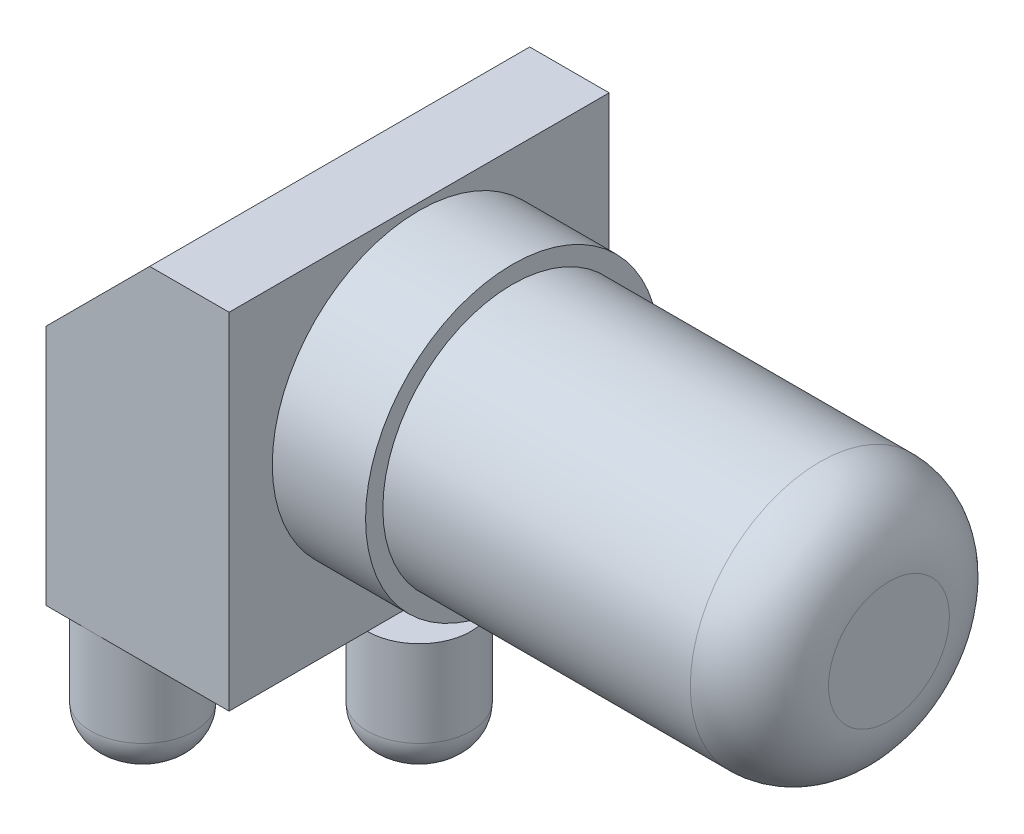
ISO-10303-21;
HEADER;
FILE_DESCRIPTION(('STEP AP214'),'2;1');
FILE_NAME('part.step','',(''),(''),'','','');
FILE_SCHEMA(('AUTOMOTIVE_DESIGN { 1 0 10303 214 1 1 1 1 }'));
ENDSEC;
DATA;
#1=APPLICATION_CONTEXT('core data for automotive mechanical design processes');
#2=APPLICATION_PROTOCOL_DEFINITION('international standard','automotive_design',2000,#1);
#3=PRODUCT_CONTEXT('',#1,'mechanical');
#4=PRODUCT('Part','Part','',(#3));
#5=PRODUCT_RELATED_PRODUCT_CATEGORY('part','',(#4));
#6=PRODUCT_DEFINITION_FORMATION('','',#4);
#7=PRODUCT_DEFINITION_CONTEXT('part definition',#1,'design');
#8=PRODUCT_DEFINITION('design','',#6,#7);
#9=PRODUCT_DEFINITION_SHAPE('','',#8);
#10=(LENGTH_UNIT() NAMED_UNIT(*) SI_UNIT(.MILLI.,.METRE.));
#11=(NAMED_UNIT(*) PLANE_ANGLE_UNIT() SI_UNIT($,.RADIAN.));
#12=(NAMED_UNIT(*) SI_UNIT($,.STERADIAN.) SOLID_ANGLE_UNIT());
#13=UNCERTAINTY_MEASURE_WITH_UNIT(LENGTH_MEASURE(1.E-05),#10,'distance_accuracy_value','');
#14=(GEOMETRIC_REPRESENTATION_CONTEXT(3) GLOBAL_UNCERTAINTY_ASSIGNED_CONTEXT((#13)) GLOBAL_UNIT_ASSIGNED_CONTEXT((#10,
#11,#12)) REPRESENTATION_CONTEXT('',''));
#15=CARTESIAN_POINT('',(0.,0.,0.));
#16=DIRECTION('',(0.,0.,1.));
#17=DIRECTION('',(1.,0.,0.));
#18=AXIS2_PLACEMENT_3D('',#15,#16,#17);
#19=CARTESIAN_POINT('',(9.144,7.0485,0.));
#20=DIRECTION('',(1.,0.,0.));
#21=DIRECTION('',(0.,0.,-1.));
#22=AXIS2_PLACEMENT_3D('',#19,#20,#21);
#23=PLANE('',#22);
#24=CARTESIAN_POINT('',(9.144,7.0485,0.));
#25=DIRECTION('',(1.,0.,0.));
#26=DIRECTION('',(0.,0.,-1.));
#27=AXIS2_PLACEMENT_3D('',#24,#25,#26);
#28=CIRCLE('',#27,5.3975);
#29=CARTESIAN_POINT('',(9.144,7.0485,-5.3975));
#30=VERTEX_POINT('',#29);
#31=EDGE_CURVE('E142',#30,#30,#28,.T.);
#32=ORIENTED_EDGE('',*,*,#31,.T.);
#33=EDGE_LOOP('',(#32));
#34=FACE_BOUND('',#33,.T.);
#35=CARTESIAN_POINT('',(9.144,7.0485,0.));
#36=DIRECTION('',(1.,0.,0.));
#37=DIRECTION('',(0.,0.,-1.));
#38=AXIS2_PLACEMENT_3D('',#35,#36,#37);
#39=CIRCLE('',#38,4.7625);
#40=CARTESIAN_POINT('',(9.144,7.0485,-4.7625));
#41=VERTEX_POINT('',#40);
#42=EDGE_CURVE('E148',#41,#41,#39,.T.);
#43=ORIENTED_EDGE('',*,*,#42,.F.);
#44=EDGE_LOOP('',(#43));
#45=FACE_BOUND('',#44,.T.);
#46=ADVANCED_FACE('F34',(#34,#45),#23,.T.);
#47=CARTESIAN_POINT('',(5.715,12.7,-6.985));
#48=DIRECTION('',(-1.,0.,0.));
#49=DIRECTION('',(0.,0.,1.));
#50=AXIS2_PLACEMENT_3D('',#47,#48,#49);
#51=PLANE('',#50);
#52=DIRECTION('',(0.,0.,-1.));
#53=VECTOR('',#52,1.);
#54=CARTESIAN_POINT('',(5.715,0.,-6.985));
#55=LINE('',#54,#53);
#56=CARTESIAN_POINT('',(5.715,0.,6.985));
#57=VERTEX_POINT('',#56);
#58=CARTESIAN_POINT('',(5.715,0.,1.905));
#59=VERTEX_POINT('',#58);
#60=EDGE_CURVE('E158',#57,#59,#55,.T.);
#61=ORIENTED_EDGE('',*,*,#60,.T.);
#62=CARTESIAN_POINT('',(5.715,0.,-1.905));
#63=VERTEX_POINT('',#62);
#64=EDGE_CURVE('E174',#59,#63,#55,.T.);
#65=ORIENTED_EDGE('',*,*,#64,.T.);
#66=CARTESIAN_POINT('',(5.715,0.,-6.985));
#67=VERTEX_POINT('',#66);
#68=EDGE_CURVE('E171',#63,#67,#55,.T.);
#69=ORIENTED_EDGE('',*,*,#68,.T.);
#70=DIRECTION('',(0.,-1.,0.));
#71=VECTOR('',#70,1.);
#72=CARTESIAN_POINT('',(5.715,12.7,-6.985));
#73=LINE('',#72,#71);
#74=CARTESIAN_POINT('',(5.715,12.7,-6.985));
#75=VERTEX_POINT('',#74);
#76=EDGE_CURVE('E162',#75,#67,#73,.T.);
#77=ORIENTED_EDGE('',*,*,#76,.F.);
#78=DIRECTION('',(0.,0.,-1.));
#79=VECTOR('',#78,1.);
#80=CARTESIAN_POINT('',(5.715,12.7,-6.985));
#81=LINE('',#80,#79);
#82=CARTESIAN_POINT('',(5.715,12.7,6.985));
#83=VERTEX_POINT('',#82);
#84=EDGE_CURVE('E160',#83,#75,#81,.T.);
#85=ORIENTED_EDGE('',*,*,#84,.F.);
#86=DIRECTION('',(0.,-1.,0.));
#87=VECTOR('',#86,1.);
#88=CARTESIAN_POINT('',(5.715,12.7,6.985));
#89=LINE('',#88,#87);
#90=EDGE_CURVE('E177',#83,#57,#89,.T.);
#91=ORIENTED_EDGE('',*,*,#90,.T.);
#92=EDGE_LOOP('',(#61,#65,#69,#77,#85,#91));
#93=FACE_BOUND('',#92,.T.);
#94=CARTESIAN_POINT('',(5.715,7.0485,0.));
#95=DIRECTION('',(-1.,0.,0.));
#96=DIRECTION('',(0.,0.,1.));
#97=AXIS2_PLACEMENT_3D('',#94,#95,#96);
#98=CIRCLE('',#97,5.3975);
#99=CARTESIAN_POINT('',(5.715,7.0485,5.3975));
#100=VERTEX_POINT('',#99);
#101=EDGE_CURVE('E200',#100,#100,#98,.F.);
#102=ORIENTED_EDGE('',*,*,#101,.F.);
#103=EDGE_LOOP('',(#102));
#104=FACE_BOUND('',#103,.T.);
#105=ADVANCED_FACE('F239',(#93,#104),#51,.F.);
#106=CARTESIAN_POINT('',(5.715,0.,-6.985));
#107=DIRECTION('',(0.,-1.,0.));
#108=DIRECTION('',(0.,0.,-1.));
#109=AXIS2_PLACEMENT_3D('',#106,#107,#108);
#110=PLANE('',#109);
#111=CARTESIAN_POINT('',(0.634999999999997,0.,5.08));
#112=DIRECTION('',(0.,-1.,0.));
#113=DIRECTION('',(0.,0.,-1.));
#114=AXIS2_PLACEMENT_3D('',#111,#112,#113);
#115=CIRCLE('',#114,1.90499999999999);
#116=CARTESIAN_POINT('',(0.634999999999997,0.,6.98499999999999));
#117=VERTEX_POINT('',#116);
#118=CARTESIAN_POINT('',(-1.016,0.,6.03038097624057));
#119=VERTEX_POINT('',#118);
#120=EDGE_CURVE('E189',#117,#119,#115,.T.);
#121=ORIENTED_EDGE('',*,*,#120,.F.);
#122=DIRECTION('',(1.,0.,0.));
#123=VECTOR('',#122,1.);
#124=CARTESIAN_POINT('',(-1.016,0.,6.985));
#125=LINE('',#124,#123);
#126=CARTESIAN_POINT('',(-1.016,0.,6.985));
#127=VERTEX_POINT('',#126);
#128=EDGE_CURVE('E169',#127,#117,#125,.T.);
#129=ORIENTED_EDGE('',*,*,#128,.F.);
#130=DIRECTION('',(0.,0.,1.));
#131=VECTOR('',#130,1.);
#132=CARTESIAN_POINT('',(-1.016,0.,-6.985));
#133=LINE('',#132,#131);
#134=EDGE_CURVE('E123',#119,#127,#133,.T.);
#135=ORIENTED_EDGE('',*,*,#134,.F.);
#136=EDGE_LOOP('',(#121,#129,#135));
#137=FACE_BOUND('',#136,.T.);
#138=ADVANCED_FACE('F245',(#137),#110,.T.);
#139=CARTESIAN_POINT('',(0.634999999999997,-4.445,-5.08));
#140=DIRECTION('',(0.,1.,0.));
#141=DIRECTION('',(0.,0.,1.));
#142=AXIS2_PLACEMENT_3D('',#139,#140,#141);
#143=CYLINDRICAL_SURFACE('',#142,1.90499999999999);
#144=CARTESIAN_POINT('',(0.634999999999997,-3.175,-5.08));
#145=DIRECTION('',(0.,1.,0.));
#146=DIRECTION('',(0.,0.,1.));
#147=AXIS2_PLACEMENT_3D('',#144,#145,#146);
#148=CIRCLE('',#147,1.90499999999999);
#149=CARTESIAN_POINT('',(0.634999999999997,-3.175,-3.17500000000001));
#150=VERTEX_POINT('',#149);
#151=EDGE_CURVE('E212',#150,#150,#148,.T.);
#152=ORIENTED_EDGE('',*,*,#151,.T.);
#153=EDGE_LOOP('',(#152));
#154=FACE_BOUND('',#153,.T.);
#155=CARTESIAN_POINT('',(0.634999999999997,0.,-5.08));
#156=DIRECTION('',(0.,1.,0.));
#157=DIRECTION('',(0.,0.,1.));
#158=AXIS2_PLACEMENT_3D('',#155,#156,#157);
#159=CIRCLE('',#158,1.90499999999999);
#160=CARTESIAN_POINT('',(0.634999999999997,0.,-6.985));
#161=VERTEX_POINT('',#160);
#162=CARTESIAN_POINT('',(-1.016,0.,-6.03038097624057));
#163=VERTEX_POINT('',#162);
#164=EDGE_CURVE('E185',#161,#163,#159,.T.);
#165=ORIENTED_EDGE('',*,*,#164,.F.);
#166=CARTESIAN_POINT('',(-1.016,0.,-4.12961902375943));
#167=VERTEX_POINT('',#166);
#168=EDGE_CURVE('E184',#167,#161,#159,.T.);
#169=ORIENTED_EDGE('',*,*,#168,.F.);
#170=EDGE_CURVE('E188',#163,#167,#159,.T.);
#171=ORIENTED_EDGE('',*,*,#170,.F.);
#172=EDGE_LOOP('',(#165,#169,#171));
#173=FACE_BOUND('',#172,.T.);
#174=ADVANCED_FACE('F305',(#154,#173),#143,.T.);
#175=CARTESIAN_POINT('',(0.634999999999997,-4.445,-5.08));
#176=DIRECTION('',(0.,1.,0.));
#177=DIRECTION('',(0.,0.,1.));
#178=AXIS2_PLACEMENT_3D('',#175,#176,#177);
#179=PLANE('',#178);
#180=CARTESIAN_POINT('',(0.634999999999997,-4.445,-5.08));
#181=DIRECTION('',(0.,1.,0.));
#182=DIRECTION('',(0.,0.,1.));
#183=AXIS2_PLACEMENT_3D('',#180,#181,#182);
#184=CIRCLE('',#183,0.634999999999993);
#185=CARTESIAN_POINT('',(0.634999999999997,-4.445,-4.44500000000001));
#186=VERTEX_POINT('',#185);
#187=EDGE_CURVE('E215',#186,#186,#184,.F.);
#188=ORIENTED_EDGE('',*,*,#187,.T.);
#189=EDGE_LOOP('',(#188));
#190=FACE_BOUND('',#189,.T.);
#191=ADVANCED_FACE('F301',(#190),#179,.F.);
#192=CARTESIAN_POINT('',(0.634999999999997,0.,-5.08));
#193=DIRECTION('',(0.,1.,0.));
#194=DIRECTION('',(0.,0.,1.));
#195=AXIS2_PLACEMENT_3D('',#192,#193,#194);
#196=PLANE('',#195);
#197=EDGE_CURVE('E168',#163,#167,#133,.T.);
#198=ORIENTED_EDGE('',*,*,#197,.F.);
#199=ORIENTED_EDGE('',*,*,#170,.T.);
#200=EDGE_LOOP('',(#198,#199));
#201=FACE_BOUND('',#200,.T.);
#202=ADVANCED_FACE('F304',(#201),#196,.T.);
#203=DIRECTION('',(-1.,0.,0.));
#204=VECTOR('',#203,1.);
#205=CARTESIAN_POINT('',(-1.016,0.,-6.985));
#206=LINE('',#205,#204);
#207=CARTESIAN_POINT('',(-1.016,0.,-6.985));
#208=VERTEX_POINT('',#207);
#209=EDGE_CURVE('E153',#161,#208,#206,.T.);
#210=ORIENTED_EDGE('',*,*,#209,.F.);
#211=ORIENTED_EDGE('',*,*,#164,.T.);
#212=EDGE_CURVE('E133',#208,#163,#133,.T.);
#213=ORIENTED_EDGE('',*,*,#212,.F.);
#214=EDGE_LOOP('',(#210,#211,#213));
#215=FACE_BOUND('',#214,.T.);
#216=ADVANCED_FACE('F291',(#215),#110,.T.);
#217=CARTESIAN_POINT('',(-1.016,12.7,-6.985));
#218=DIRECTION('',(0.,0.,1.));
#219=DIRECTION('',(1.,0.,0.));
#220=AXIS2_PLACEMENT_3D('',#217,#218,#219);
#221=PLANE('',#220);
#222=DIRECTION('',(0.,-1.,0.));
#223=VECTOR('',#222,1.);
#224=CARTESIAN_POINT('',(-1.016,12.7,-6.985));
#225=LINE('',#224,#223);
#226=CARTESIAN_POINT('',(-1.016,8.88999999999998,-6.985));
#227=VERTEX_POINT('',#226);
#228=EDGE_CURVE('E182',#227,#208,#225,.T.);
#229=ORIENTED_EDGE('',*,*,#228,.F.);
#230=DIRECTION('',(-0.707106781186546,-0.707106781186549,0.));
#231=VECTOR('',#230,1.);
#232=CARTESIAN_POINT('',(2.794,12.7,-6.985));
#233=LINE('',#232,#231);
#234=CARTESIAN_POINT('',(2.794,12.7,-6.985));
#235=VERTEX_POINT('',#234);
#236=EDGE_CURVE('E198',#227,#235,#233,.F.);
#237=ORIENTED_EDGE('',*,*,#236,.T.);
#238=DIRECTION('',(-1.,0.,0.));
#239=VECTOR('',#238,1.);
#240=CARTESIAN_POINT('',(-1.016,12.7,-6.985));
#241=LINE('',#240,#239);
#242=EDGE_CURVE('E154',#75,#235,#241,.T.);
#243=ORIENTED_EDGE('',*,*,#242,.F.);
#244=ORIENTED_EDGE('',*,*,#76,.T.);
#245=EDGE_CURVE('E163',#67,#161,#206,.T.);
#246=ORIENTED_EDGE('',*,*,#245,.T.);
#247=ORIENTED_EDGE('',*,*,#209,.T.);
#248=EDGE_LOOP('',(#229,#237,#243,#244,#246,#247));
#249=FACE_BOUND('',#248,.T.);
#250=ADVANCED_FACE('F297',(#249),#221,.F.);
#251=CARTESIAN_POINT('',(-1.016,12.7,-6.985));
#252=DIRECTION('',(1.,0.,0.));
#253=DIRECTION('',(0.,0.,-1.));
#254=AXIS2_PLACEMENT_3D('',#251,#252,#253);
#255=PLANE('',#254);
#256=DIRECTION('',(0.,-1.,0.));
#257=VECTOR('',#256,1.);
#258=CARTESIAN_POINT('',(-1.016,12.7,6.985));
#259=LINE('',#258,#257);
#260=CARTESIAN_POINT('',(-1.016,8.88999999999998,6.985));
#261=VERTEX_POINT('',#260);
#262=EDGE_CURVE('E180',#261,#127,#259,.T.);
#263=ORIENTED_EDGE('',*,*,#262,.F.);
#264=DIRECTION('',(0.,0.,-1.));
#265=VECTOR('',#264,1.);
#266=CARTESIAN_POINT('',(-1.016,8.88999999999998,-6.985));
#267=LINE('',#266,#265);
#268=EDGE_CURVE('E49',#261,#227,#267,.T.);
#269=ORIENTED_EDGE('',*,*,#268,.T.);
#270=ORIENTED_EDGE('',*,*,#228,.T.);
#271=ORIENTED_EDGE('',*,*,#212,.T.);
#272=ORIENTED_EDGE('',*,*,#197,.T.);
#273=CARTESIAN_POINT('',(-1.016,0.,-0.761999999999998));
#274=VERTEX_POINT('',#273);
#275=EDGE_CURVE('E118',#167,#274,#133,.T.);
#276=ORIENTED_EDGE('',*,*,#275,.T.);
#277=CARTESIAN_POINT('',(-1.016,0.,0.761999999999998));
#278=VERTEX_POINT('',#277);
#279=EDGE_CURVE('E110',#274,#278,#133,.T.);
#280=ORIENTED_EDGE('',*,*,#279,.T.);
#281=CARTESIAN_POINT('',(-1.016,0.,4.12961902375943));
#282=VERTEX_POINT('',#281);
#283=EDGE_CURVE('E114',#278,#282,#133,.T.);
#284=ORIENTED_EDGE('',*,*,#283,.T.);
#285=EDGE_CURVE('E132',#282,#119,#133,.T.);
#286=ORIENTED_EDGE('',*,*,#285,.T.);
#287=ORIENTED_EDGE('',*,*,#134,.T.);
#288=EDGE_LOOP('',(#263,#269,#270,#271,#272,#276,#280,#284,#286,#287));
#289=FACE_BOUND('',#288,.T.);
#290=ADVANCED_FACE('F112',(#289),#255,.F.);
#291=CARTESIAN_POINT('',(-1.016,12.7,6.985));
#292=DIRECTION('',(0.,0.,-1.));
#293=DIRECTION('',(-1.,0.,0.));
#294=AXIS2_PLACEMENT_3D('',#291,#292,#293);
#295=PLANE('',#294);
#296=DIRECTION('',(1.,0.,0.));
#297=VECTOR('',#296,1.);
#298=CARTESIAN_POINT('',(-1.016,12.7,6.985));
#299=LINE('',#298,#297);
#300=CARTESIAN_POINT('',(2.794,12.7,6.985));
#301=VERTEX_POINT('',#300);
#302=EDGE_CURVE('E157',#301,#83,#299,.T.);
#303=ORIENTED_EDGE('',*,*,#302,.F.);
#304=DIRECTION('',(0.707106781186546,0.707106781186549,0.));
#305=VECTOR('',#304,1.);
#306=CARTESIAN_POINT('',(2.794,12.7,6.985));
#307=LINE('',#306,#305);
#308=EDGE_CURVE('E57',#301,#261,#307,.F.);
#309=ORIENTED_EDGE('',*,*,#308,.T.);
#310=ORIENTED_EDGE('',*,*,#262,.T.);
#311=ORIENTED_EDGE('',*,*,#128,.T.);
#312=EDGE_CURVE('E167',#117,#57,#125,.T.);
#313=ORIENTED_EDGE('',*,*,#312,.T.);
#314=ORIENTED_EDGE('',*,*,#90,.F.);
#315=EDGE_LOOP('',(#303,#309,#310,#311,#313,#314));
#316=FACE_BOUND('',#315,.T.);
#317=ADVANCED_FACE('F288',(#316),#295,.F.);
#318=CARTESIAN_POINT('',(5.715,12.7,-6.985));
#319=DIRECTION('',(0.,-1.,0.));
#320=DIRECTION('',(0.,0.,-1.));
#321=AXIS2_PLACEMENT_3D('',#318,#319,#320);
#322=PLANE('',#321);
#323=ORIENTED_EDGE('',*,*,#242,.T.);
#324=DIRECTION('',(0.,0.,1.));
#325=VECTOR('',#324,1.);
#326=CARTESIAN_POINT('',(2.794,12.7,-6.985));
#327=LINE('',#326,#325);
#328=EDGE_CURVE('E137',#235,#301,#327,.T.);
#329=ORIENTED_EDGE('',*,*,#328,.T.);
#330=ORIENTED_EDGE('',*,*,#302,.T.);
#331=ORIENTED_EDGE('',*,*,#84,.T.);
#332=EDGE_LOOP('',(#323,#329,#330,#331));
#333=FACE_BOUND('',#332,.T.);
#334=ADVANCED_FACE('F285',(#333),#322,.F.);
#335=CARTESIAN_POINT('',(0.,0.,0.));
#336=DIRECTION('',(0.,-1.,0.));
#337=DIRECTION('',(0.,0.,-1.));
#338=AXIS2_PLACEMENT_3D('',#335,#336,#337);
#339=CIRCLE('',#338,1.27);
#340=EDGE_CURVE('E127',#274,#278,#339,.T.);
#341=ORIENTED_EDGE('',*,*,#340,.F.);
#342=ORIENTED_EDGE('',*,*,#275,.F.);
#343=ORIENTED_EDGE('',*,*,#168,.T.);
#344=ORIENTED_EDGE('',*,*,#245,.F.);
#345=ORIENTED_EDGE('',*,*,#68,.F.);
#346=CARTESIAN_POINT('',(5.715,0.,0.));
#347=DIRECTION('',(0.,-1.,0.));
#348=DIRECTION('',(0.,0.,-1.));
#349=AXIS2_PLACEMENT_3D('',#346,#347,#348);
#350=CIRCLE('',#349,1.905);
#351=EDGE_CURVE('E138',#59,#63,#350,.T.);
#352=ORIENTED_EDGE('',*,*,#351,.F.);
#353=ORIENTED_EDGE('',*,*,#60,.F.);
#354=ORIENTED_EDGE('',*,*,#312,.F.);
#355=CARTESIAN_POINT('',(0.634999999999997,0.,5.08));
#356=DIRECTION('',(0.,1.,0.));
#357=DIRECTION('',(0.,0.,1.));
#358=AXIS2_PLACEMENT_3D('',#355,#356,#357);
#359=CIRCLE('',#358,1.90499999999999);
#360=EDGE_CURVE('E130',#117,#282,#359,.T.);
#361=ORIENTED_EDGE('',*,*,#360,.T.);
#362=ORIENTED_EDGE('',*,*,#283,.F.);
#363=EDGE_LOOP('',(#341,#342,#343,#344,#345,#352,#353,#354,#361,#362));
#364=FACE_BOUND('',#363,.T.);
#365=ADVANCED_FACE('F126',(#364),#110,.T.);
#366=CARTESIAN_POINT('',(0.634999999999997,0.,5.08));
#367=DIRECTION('',(0.,1.,0.));
#368=DIRECTION('',(0.,0.,1.));
#369=AXIS2_PLACEMENT_3D('',#366,#367,#368);
#370=PLANE('',#369);
#371=ORIENTED_EDGE('',*,*,#285,.F.);
#372=EDGE_CURVE('E145',#282,#119,#359,.T.);
#373=ORIENTED_EDGE('',*,*,#372,.T.);
#374=EDGE_LOOP('',(#371,#373));
#375=FACE_BOUND('',#374,.T.);
#376=ADVANCED_FACE('F279',(#375),#370,.T.);
#377=CARTESIAN_POINT('',(0.634999999999997,-4.445,5.08));
#378=DIRECTION('',(0.,1.,0.));
#379=DIRECTION('',(0.,0.,1.));
#380=AXIS2_PLACEMENT_3D('',#377,#378,#379);
#381=CYLINDRICAL_SURFACE('',#380,1.90499999999999);
#382=CARTESIAN_POINT('',(0.634999999999997,-3.175,5.08));
#383=DIRECTION('',(0.,1.,0.));
#384=DIRECTION('',(0.,0.,1.));
#385=AXIS2_PLACEMENT_3D('',#382,#383,#384);
#386=CIRCLE('',#385,1.90499999999999);
#387=CARTESIAN_POINT('',(0.634999999999997,-3.175,6.98499999999999));
#388=VERTEX_POINT('',#387);
#389=EDGE_CURVE('E42',#388,#388,#386,.T.);
#390=ORIENTED_EDGE('',*,*,#389,.T.);
#391=EDGE_LOOP('',(#390));
#392=FACE_BOUND('',#391,.T.);
#393=ORIENTED_EDGE('',*,*,#360,.F.);
#394=ORIENTED_EDGE('',*,*,#120,.T.);
#395=ORIENTED_EDGE('',*,*,#372,.F.);
#396=EDGE_LOOP('',(#393,#394,#395));
#397=FACE_BOUND('',#396,.T.);
#398=ADVANCED_FACE('F226',(#392,#397),#381,.T.);
#399=CARTESIAN_POINT('',(0.634999999999997,-4.445,5.08));
#400=DIRECTION('',(0.,1.,0.));
#401=DIRECTION('',(0.,0.,1.));
#402=AXIS2_PLACEMENT_3D('',#399,#400,#401);
#403=PLANE('',#402);
#404=CARTESIAN_POINT('',(0.634999999999997,-4.445,5.08));
#405=DIRECTION('',(0.,1.,0.));
#406=DIRECTION('',(0.,0.,1.));
#407=AXIS2_PLACEMENT_3D('',#404,#405,#406);
#408=CIRCLE('',#407,0.634999999999993);
#409=CARTESIAN_POINT('',(0.634999999999997,-4.445,5.71499999999999));
#410=VERTEX_POINT('',#409);
#411=EDGE_CURVE('E11',#410,#410,#408,.F.);
#412=ORIENTED_EDGE('',*,*,#411,.T.);
#413=EDGE_LOOP('',(#412));
#414=FACE_BOUND('',#413,.T.);
#415=ADVANCED_FACE('F271',(#414),#403,.F.);
#416=CARTESIAN_POINT('',(5.715,0.,0.));
#417=DIRECTION('',(0.,1.,0.));
#418=DIRECTION('',(0.,0.,1.));
#419=AXIS2_PLACEMENT_3D('',#416,#417,#418);
#420=PLANE('',#419);
#421=ORIENTED_EDGE('',*,*,#64,.F.);
#422=CARTESIAN_POINT('',(5.715,0.,0.));
#423=DIRECTION('',(0.,1.,0.));
#424=DIRECTION('',(0.,0.,1.));
#425=AXIS2_PLACEMENT_3D('',#422,#423,#424);
#426=CIRCLE('',#425,1.905);
#427=EDGE_CURVE('E141',#59,#63,#426,.T.);
#428=ORIENTED_EDGE('',*,*,#427,.T.);
#429=EDGE_LOOP('',(#421,#428));
#430=FACE_BOUND('',#429,.T.);
#431=ADVANCED_FACE('F268',(#430),#420,.T.);
#432=CARTESIAN_POINT('',(5.715,-4.445,0.));
#433=DIRECTION('',(0.,1.,0.));
#434=DIRECTION('',(0.,0.,1.));
#435=AXIS2_PLACEMENT_3D('',#432,#433,#434);
#436=CYLINDRICAL_SURFACE('',#435,1.905);
#437=CARTESIAN_POINT('',(5.715,-3.175,0.));
#438=DIRECTION('',(0.,1.,0.));
#439=DIRECTION('',(0.,0.,1.));
#440=AXIS2_PLACEMENT_3D('',#437,#438,#439);
#441=CIRCLE('',#440,1.905);
#442=CARTESIAN_POINT('',(5.715,-3.175,1.905));
#443=VERTEX_POINT('',#442);
#444=EDGE_CURVE('E218',#443,#443,#441,.T.);
#445=ORIENTED_EDGE('',*,*,#444,.T.);
#446=EDGE_LOOP('',(#445));
#447=FACE_BOUND('',#446,.T.);
#448=ORIENTED_EDGE('',*,*,#427,.F.);
#449=ORIENTED_EDGE('',*,*,#351,.T.);
#450=EDGE_LOOP('',(#448,#449));
#451=FACE_BOUND('',#450,.T.);
#452=ADVANCED_FACE('F266',(#447,#451),#436,.T.);
#453=CARTESIAN_POINT('',(5.715,-4.445,0.));
#454=DIRECTION('',(0.,1.,0.));
#455=DIRECTION('',(0.,0.,1.));
#456=AXIS2_PLACEMENT_3D('',#453,#454,#455);
#457=PLANE('',#456);
#458=CARTESIAN_POINT('',(5.715,-4.445,0.));
#459=DIRECTION('',(0.,1.,0.));
#460=DIRECTION('',(0.,0.,1.));
#461=AXIS2_PLACEMENT_3D('',#458,#459,#460);
#462=CIRCLE('',#461,0.635);
#463=CARTESIAN_POINT('',(5.715,-4.445,0.635));
#464=VERTEX_POINT('',#463);
#465=EDGE_CURVE('E221',#464,#464,#462,.F.);
#466=ORIENTED_EDGE('',*,*,#465,.T.);
#467=EDGE_LOOP('',(#466));
#468=FACE_BOUND('',#467,.T.);
#469=ADVANCED_FACE('F260',(#468),#457,.F.);
#470=CARTESIAN_POINT('',(0.,0.,0.));
#471=DIRECTION('',(0.,1.,0.));
#472=DIRECTION('',(0.,0.,1.));
#473=AXIS2_PLACEMENT_3D('',#470,#471,#472);
#474=PLANE('',#473);
#475=ORIENTED_EDGE('',*,*,#279,.F.);
#476=CARTESIAN_POINT('',(0.,0.,0.));
#477=DIRECTION('',(0.,1.,0.));
#478=DIRECTION('',(0.,0.,1.));
#479=AXIS2_PLACEMENT_3D('',#476,#477,#478);
#480=CIRCLE('',#479,1.27);
#481=EDGE_CURVE('E136',#274,#278,#480,.T.);
#482=ORIENTED_EDGE('',*,*,#481,.T.);
#483=EDGE_LOOP('',(#475,#482));
#484=FACE_BOUND('',#483,.T.);
#485=ADVANCED_FACE('F140',(#484),#474,.T.);
#486=CARTESIAN_POINT('',(0.,-4.445,0.));
#487=DIRECTION('',(0.,1.,0.));
#488=DIRECTION('',(0.,0.,1.));
#489=AXIS2_PLACEMENT_3D('',#486,#487,#488);
#490=CYLINDRICAL_SURFACE('',#489,1.27);
#491=CARTESIAN_POINT('',(0.,-3.175,0.));
#492=DIRECTION('',(0.,1.,0.));
#493=DIRECTION('',(0.,0.,1.));
#494=AXIS2_PLACEMENT_3D('',#491,#492,#493);
#495=CIRCLE('',#494,1.27);
#496=CARTESIAN_POINT('',(0.,-3.175,1.27));
#497=VERTEX_POINT('',#496);
#498=EDGE_CURVE('E209',#497,#497,#495,.T.);
#499=ORIENTED_EDGE('',*,*,#498,.T.);
#500=EDGE_LOOP('',(#499));
#501=FACE_BOUND('',#500,.T.);
#502=ORIENTED_EDGE('',*,*,#481,.F.);
#503=ORIENTED_EDGE('',*,*,#340,.T.);
#504=EDGE_LOOP('',(#502,#503));
#505=FACE_BOUND('',#504,.T.);
#506=ADVANCED_FACE('F135',(#501,#505),#490,.T.);
#507=CARTESIAN_POINT('',(2.794,12.7,-6.985));
#508=DIRECTION('',(0.707106781186549,-0.707106781186546,0.));
#509=DIRECTION('',(0.707106781186546,0.707106781186549,0.));
#510=AXIS2_PLACEMENT_3D('',#507,#508,#509);
#511=PLANE('',#510);
#512=ORIENTED_EDGE('',*,*,#236,.F.);
#513=ORIENTED_EDGE('',*,*,#268,.F.);
#514=ORIENTED_EDGE('',*,*,#308,.F.);
#515=ORIENTED_EDGE('',*,*,#328,.F.);
#516=EDGE_LOOP('',(#512,#513,#514,#515));
#517=FACE_BOUND('',#516,.T.);
#518=ADVANCED_FACE('F256',(#517),#511,.F.);
#519=CARTESIAN_POINT('',(9.144,7.0485,0.));
#520=DIRECTION('',(-1.,0.,0.));
#521=DIRECTION('',(0.,0.,1.));
#522=AXIS2_PLACEMENT_3D('',#519,#520,#521);
#523=CYLINDRICAL_SURFACE('',#522,5.3975);
#524=ORIENTED_EDGE('',*,*,#31,.F.);
#525=EDGE_LOOP('',(#524));
#526=FACE_BOUND('',#525,.T.);
#527=ORIENTED_EDGE('',*,*,#101,.T.);
#528=EDGE_LOOP('',(#527));
#529=FACE_BOUND('',#528,.T.);
#530=ADVANCED_FACE('F253',(#526,#529),#523,.T.);
#531=CARTESIAN_POINT('',(22.987,7.0485,0.));
#532=DIRECTION('',(-1.,0.,0.));
#533=DIRECTION('',(0.,0.,1.));
#534=AXIS2_PLACEMENT_3D('',#531,#532,#533);
#535=CYLINDRICAL_SURFACE('',#534,4.7625);
#536=CARTESIAN_POINT('',(20.447,7.0485,0.));
#537=DIRECTION('',(1.,0.,0.));
#538=DIRECTION('',(0.,0.,-1.));
#539=AXIS2_PLACEMENT_3D('',#536,#537,#538);
#540=CIRCLE('',#539,4.7625);
#541=CARTESIAN_POINT('',(20.447,7.0485,-4.7625));
#542=VERTEX_POINT('',#541);
#543=EDGE_CURVE('E206',#542,#542,#540,.F.);
#544=ORIENTED_EDGE('',*,*,#543,.T.);
#545=EDGE_LOOP('',(#544));
#546=FACE_BOUND('',#545,.T.);
#547=ORIENTED_EDGE('',*,*,#42,.T.);
#548=EDGE_LOOP('',(#547));
#549=FACE_BOUND('',#548,.T.);
#550=ADVANCED_FACE('F251',(#546,#549),#535,.T.);
#551=CARTESIAN_POINT('',(22.987,7.0485,0.));
#552=DIRECTION('',(1.,0.,0.));
#553=DIRECTION('',(0.,0.,-1.));
#554=AXIS2_PLACEMENT_3D('',#551,#552,#553);
#555=PLANE('',#554);
#556=CARTESIAN_POINT('',(22.987,7.0485,0.));
#557=DIRECTION('',(1.,0.,0.));
#558=DIRECTION('',(0.,0.,-1.));
#559=AXIS2_PLACEMENT_3D('',#556,#557,#558);
#560=CIRCLE('',#559,2.2225);
#561=CARTESIAN_POINT('',(22.987,7.0485,-2.2225));
#562=VERTEX_POINT('',#561);
#563=EDGE_CURVE('E203',#562,#562,#560,.T.);
#564=ORIENTED_EDGE('',*,*,#563,.T.);
#565=EDGE_LOOP('',(#564));
#566=FACE_BOUND('',#565,.T.);
#567=ADVANCED_FACE('F320',(#566),#555,.T.);
#568=CARTESIAN_POINT('',(20.447,7.0485,0.));
#569=DIRECTION('',(1.,0.,0.));
#570=DIRECTION('',(0.,0.,-1.));
#571=AXIS2_PLACEMENT_3D('',#568,#569,#570);
#572=DEGENERATE_TOROIDAL_SURFACE('',#571,2.2225,2.54,.T.);
#573=ORIENTED_EDGE('',*,*,#543,.F.);
#574=EDGE_LOOP('',(#573));
#575=FACE_BOUND('',#574,.T.);
#576=ORIENTED_EDGE('',*,*,#563,.F.);
#577=EDGE_LOOP('',(#576));
#578=FACE_BOUND('',#577,.T.);
#579=ADVANCED_FACE('F316',(#575,#578),#572,.T.);
#580=CARTESIAN_POINT('',(0.,-3.175,0.));
#581=DIRECTION('',(0.,0.,1.));
#582=DIRECTION('',(1.,0.,0.));
#583=AXIS2_PLACEMENT_3D('',#580,#581,#582);
#584=SPHERICAL_SURFACE('',#583,1.27);
#585=CARTESIAN_POINT('',(0.,-3.175,0.));
#586=DIRECTION('',(0.,1.,0.));
#587=DIRECTION('',(0.,0.,1.));
#588=AXIS2_PLACEMENT_3D('',#585,#586,#587);
#589=SPHERICAL_SURFACE('',#588,1.27);
#590=ORIENTED_EDGE('',*,*,#498,.F.);
#591=EDGE_LOOP('',(#590));
#592=FACE_BOUND('',#591,.T.);
#593=ADVANCED_FACE('F319',(#592),#589,.T.);
#594=CARTESIAN_POINT('',(0.634999999999997,-3.175,-5.08));
#595=DIRECTION('',(0.,1.,0.));
#596=DIRECTION('',(0.,0.,1.));
#597=AXIS2_PLACEMENT_3D('',#594,#595,#596);
#598=DEGENERATE_TOROIDAL_SURFACE('',#597,0.634999999999993,1.27,.T.);
#599=ORIENTED_EDGE('',*,*,#187,.F.);
#600=EDGE_LOOP('',(#599));
#601=FACE_BOUND('',#600,.T.);
#602=ORIENTED_EDGE('',*,*,#151,.F.);
#603=EDGE_LOOP('',(#602));
#604=FACE_BOUND('',#603,.T.);
#605=ADVANCED_FACE('F235',(#601,#604),#598,.T.);
#606=CARTESIAN_POINT('',(5.715,-3.175,0.));
#607=DIRECTION('',(0.,1.,0.));
#608=DIRECTION('',(0.,0.,1.));
#609=AXIS2_PLACEMENT_3D('',#606,#607,#608);
#610=DEGENERATE_TOROIDAL_SURFACE('',#609,0.635,1.27,.T.);
#611=ORIENTED_EDGE('',*,*,#465,.F.);
#612=EDGE_LOOP('',(#611));
#613=FACE_BOUND('',#612,.T.);
#614=ORIENTED_EDGE('',*,*,#444,.F.);
#615=EDGE_LOOP('',(#614));
#616=FACE_BOUND('',#615,.T.);
#617=ADVANCED_FACE('F230',(#613,#616),#610,.T.);
#618=CARTESIAN_POINT('',(0.634999999999997,-3.175,5.08));
#619=DIRECTION('',(0.,1.,0.));
#620=DIRECTION('',(0.,0.,1.));
#621=AXIS2_PLACEMENT_3D('',#618,#619,#620);
#622=DEGENERATE_TOROIDAL_SURFACE('',#621,0.634999999999993,1.27,.T.);
#623=ORIENTED_EDGE('',*,*,#411,.F.);
#624=EDGE_LOOP('',(#623));
#625=FACE_BOUND('',#624,.T.);
#626=ORIENTED_EDGE('',*,*,#389,.F.);
#627=EDGE_LOOP('',(#626));
#628=FACE_BOUND('',#627,.T.);
#629=ADVANCED_FACE('F36',(#625,#628),#622,.T.);
#630=CLOSED_SHELL('',(#46,#105,#138,#174,#191,#202,#216,#250,#290,#317,#334,#365,#376,#398,#415,
#431,#452,#469,#485,#506,#518,#530,#550,#567,#579,#593,#605,#617,#629));
#631=MANIFOLD_SOLID_BREP('B2',#630);
#632=ADVANCED_BREP_SHAPE_REPRESENTATION('',(#18,#631),#14);
#633=SHAPE_DEFINITION_REPRESENTATION(#9,#632);
ENDSEC;
END-ISO-10303-21;
